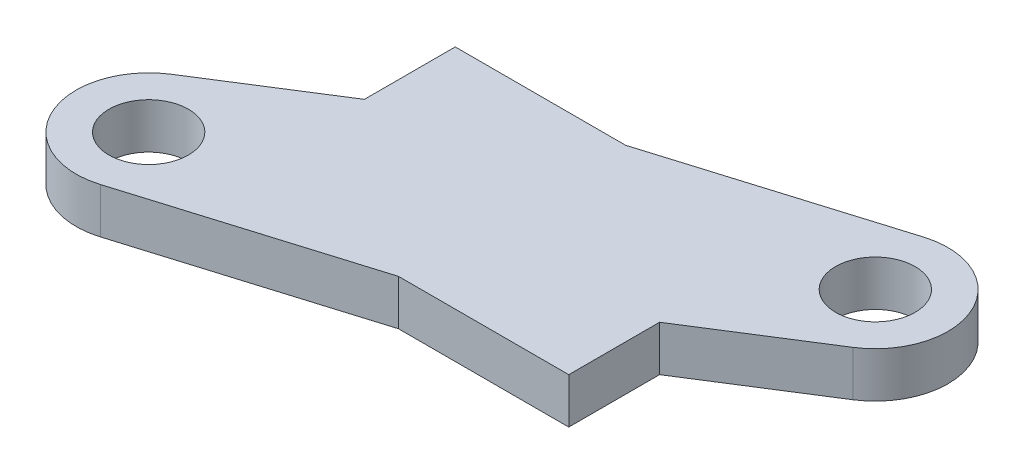
ISO-10303-21;
HEADER;
FILE_DESCRIPTION(('STEP AP214'),'2;1');
FILE_NAME('part.step','',(''),(''),'','','');
FILE_SCHEMA(('AUTOMOTIVE_DESIGN { 1 0 10303 214 1 1 1 1 }'));
ENDSEC;
DATA;
#1=APPLICATION_CONTEXT('core data for automotive mechanical design processes');
#2=APPLICATION_PROTOCOL_DEFINITION('international standard','automotive_design',2000,#1);
#3=PRODUCT_CONTEXT('',#1,'mechanical');
#4=PRODUCT('Part','Part','',(#3));
#5=PRODUCT_RELATED_PRODUCT_CATEGORY('part','',(#4));
#6=PRODUCT_DEFINITION_FORMATION('','',#4);
#7=PRODUCT_DEFINITION_CONTEXT('part definition',#1,'design');
#8=PRODUCT_DEFINITION('design','',#6,#7);
#9=PRODUCT_DEFINITION_SHAPE('','',#8);
#10=(LENGTH_UNIT() NAMED_UNIT(*) SI_UNIT(.MILLI.,.METRE.));
#11=(NAMED_UNIT(*) PLANE_ANGLE_UNIT() SI_UNIT($,.RADIAN.));
#12=(NAMED_UNIT(*) SI_UNIT($,.STERADIAN.) SOLID_ANGLE_UNIT());
#13=UNCERTAINTY_MEASURE_WITH_UNIT(LENGTH_MEASURE(1.E-05),#10,'distance_accuracy_value','');
#14=(GEOMETRIC_REPRESENTATION_CONTEXT(3) GLOBAL_UNCERTAINTY_ASSIGNED_CONTEXT((#13)) GLOBAL_UNIT_ASSIGNED_CONTEXT((#10,
#11,#12)) REPRESENTATION_CONTEXT('',''));
#15=CARTESIAN_POINT('',(0.,0.,0.));
#16=DIRECTION('',(0.,0.,1.));
#17=DIRECTION('',(1.,0.,0.));
#18=AXIS2_PLACEMENT_3D('',#15,#16,#17);
#19=CARTESIAN_POINT('',(-11.,0.,5.));
#20=DIRECTION('',(0.,1.,0.));
#21=DIRECTION('',(0.,0.,1.));
#22=AXIS2_PLACEMENT_3D('',#19,#20,#21);
#23=PLANE('',#22);
#24=CARTESIAN_POINT('',(11.,0.,-5.));
#25=DIRECTION('',(0.,-1.,0.));
#26=DIRECTION('',(0.,0.,-1.));
#27=AXIS2_PLACEMENT_3D('',#24,#25,#26);
#28=CIRCLE('',#27,1.75);
#29=CARTESIAN_POINT('',(11.,0.,-6.75));
#30=VERTEX_POINT('',#29);
#31=EDGE_CURVE('E180',#30,#30,#28,.F.);
#32=ORIENTED_EDGE('',*,*,#31,.T.);
#33=EDGE_LOOP('',(#32));
#34=FACE_BOUND('',#33,.T.);
#35=DIRECTION('',(1.,0.,0.));
#36=VECTOR('',#35,1.);
#37=CARTESIAN_POINT('',(-7.5,0.,-5.));
#38=LINE('',#37,#36);
#39=CARTESIAN_POINT('',(-7.5,0.,-5.));
#40=VERTEX_POINT('',#39);
#41=CARTESIAN_POINT('',(0.,0.,-5.));
#42=VERTEX_POINT('',#41);
#43=EDGE_CURVE('E106',#40,#42,#38,.T.);
#44=ORIENTED_EDGE('',*,*,#43,.T.);
#45=DIRECTION('',(0.956750699412572,0.,-0.290909090909091));
#46=VECTOR('',#45,1.);
#47=CARTESIAN_POINT('',(10.0690909090909,0.,-8.06160223812023));
#48=LINE('',#47,#46);
#49=CARTESIAN_POINT('',(10.0690909090909,0.,-8.06160223812023));
#50=VERTEX_POINT('',#49);
#51=EDGE_CURVE('E103',#42,#50,#48,.T.);
#52=ORIENTED_EDGE('',*,*,#51,.T.);
#53=CARTESIAN_POINT('',(11.,0.,-5.));
#54=DIRECTION('',(0.,-1.,0.));
#55=DIRECTION('',(0.,0.,-1.));
#56=AXIS2_PLACEMENT_3D('',#53,#54,#55);
#57=CIRCLE('',#56,3.2);
#58=CARTESIAN_POINT('',(12.7105144267153,0.,-2.29553325108276));
#59=VERTEX_POINT('',#58);
#60=EDGE_CURVE('E92',#59,#50,#57,.F.);
#61=ORIENTED_EDGE('',*,*,#60,.F.);
#62=DIRECTION('',(-0.845145859036636,0.,0.534535758348519));
#63=VECTOR('',#62,1.);
#64=CARTESIAN_POINT('',(12.7105144267153,0.,-2.29553325108276));
#65=LINE('',#64,#63);
#66=CARTESIAN_POINT('',(7.5,0.,1.));
#67=VERTEX_POINT('',#66);
#68=EDGE_CURVE('E125',#59,#67,#65,.T.);
#69=ORIENTED_EDGE('',*,*,#68,.T.);
#70=DIRECTION('',(0.,0.,1.));
#71=VECTOR('',#70,1.);
#72=CARTESIAN_POINT('',(7.5,0.,1.));
#73=LINE('',#72,#71);
#74=CARTESIAN_POINT('',(7.5,0.,5.));
#75=VERTEX_POINT('',#74);
#76=EDGE_CURVE('E128',#67,#75,#73,.T.);
#77=ORIENTED_EDGE('',*,*,#76,.T.);
#78=DIRECTION('',(-1.,0.,0.));
#79=VECTOR('',#78,1.);
#80=CARTESIAN_POINT('',(0.,0.,5.));
#81=LINE('',#80,#79);
#82=CARTESIAN_POINT('',(0.,0.,5.));
#83=VERTEX_POINT('',#82);
#84=EDGE_CURVE('E140',#75,#83,#81,.T.);
#85=ORIENTED_EDGE('',*,*,#84,.T.);
#86=DIRECTION('',(-0.956750699412572,0.,0.290909090909091));
#87=VECTOR('',#86,1.);
#88=CARTESIAN_POINT('',(-10.0690909090909,0.,8.06160223812024));
#89=LINE('',#88,#87);
#90=CARTESIAN_POINT('',(-10.0690909090909,0.,8.06160223812024));
#91=VERTEX_POINT('',#90);
#92=EDGE_CURVE('E150',#83,#91,#89,.T.);
#93=ORIENTED_EDGE('',*,*,#92,.T.);
#94=CARTESIAN_POINT('',(-11.,0.,5.));
#95=DIRECTION('',(0.,-1.,0.));
#96=DIRECTION('',(0.,0.,-1.));
#97=AXIS2_PLACEMENT_3D('',#94,#95,#96);
#98=CIRCLE('',#97,3.2);
#99=CARTESIAN_POINT('',(-12.7105144267153,0.,2.29553325108277));
#100=VERTEX_POINT('',#99);
#101=EDGE_CURVE('E158',#100,#91,#98,.F.);
#102=ORIENTED_EDGE('',*,*,#101,.F.);
#103=DIRECTION('',(0.845145859036636,0.,-0.534535758348519));
#104=VECTOR('',#103,1.);
#105=CARTESIAN_POINT('',(-12.7105144267153,0.,2.29553325108277));
#106=LINE('',#105,#104);
#107=CARTESIAN_POINT('',(-7.5,0.,-1.));
#108=VERTEX_POINT('',#107);
#109=EDGE_CURVE('E161',#100,#108,#106,.T.);
#110=ORIENTED_EDGE('',*,*,#109,.T.);
#111=DIRECTION('',(0.,0.,-1.));
#112=VECTOR('',#111,1.);
#113=CARTESIAN_POINT('',(-7.5,0.,-5.));
#114=LINE('',#113,#112);
#115=EDGE_CURVE('E162',#108,#40,#114,.T.);
#116=ORIENTED_EDGE('',*,*,#115,.T.);
#117=EDGE_LOOP('',(#44,#52,#61,#69,#77,#85,#93,#102,#110,#116));
#118=FACE_BOUND('',#117,.T.);
#119=CARTESIAN_POINT('',(-11.,0.,5.));
#120=DIRECTION('',(0.,-1.,0.));
#121=DIRECTION('',(0.,0.,-1.));
#122=AXIS2_PLACEMENT_3D('',#119,#120,#121);
#123=CIRCLE('',#122,1.75);
#124=CARTESIAN_POINT('',(-11.,0.,3.25));
#125=VERTEX_POINT('',#124);
#126=EDGE_CURVE('E20',#125,#125,#123,.F.);
#127=ORIENTED_EDGE('',*,*,#126,.T.);
#128=EDGE_LOOP('',(#127));
#129=FACE_BOUND('',#128,.T.);
#130=ADVANCED_FACE('F17',(#34,#118,#129),#23,.F.);
#131=CARTESIAN_POINT('',(-11.,2.,5.));
#132=DIRECTION('',(0.,-1.,0.));
#133=DIRECTION('',(0.,0.,-1.));
#134=AXIS2_PLACEMENT_3D('',#131,#132,#133);
#135=CYLINDRICAL_SURFACE('',#134,1.75);
#136=CARTESIAN_POINT('',(-11.,2.,5.));
#137=DIRECTION('',(0.,-1.,0.));
#138=DIRECTION('',(0.,0.,-1.));
#139=AXIS2_PLACEMENT_3D('',#136,#137,#138);
#140=CIRCLE('',#139,1.75);
#141=CARTESIAN_POINT('',(-11.,2.,3.25));
#142=VERTEX_POINT('',#141);
#143=EDGE_CURVE('E169',#142,#142,#140,.T.);
#144=ORIENTED_EDGE('',*,*,#143,.F.);
#145=EDGE_LOOP('',(#144));
#146=FACE_BOUND('',#145,.T.);
#147=ORIENTED_EDGE('',*,*,#126,.F.);
#148=EDGE_LOOP('',(#147));
#149=FACE_BOUND('',#148,.T.);
#150=ADVANCED_FACE('F335',(#146,#149),#135,.F.);
#151=CARTESIAN_POINT('',(-7.5,2.,-5.));
#152=DIRECTION('',(1.,0.,0.));
#153=DIRECTION('',(0.,0.,-1.));
#154=AXIS2_PLACEMENT_3D('',#151,#152,#153);
#155=PLANE('',#154);
#156=DIRECTION('',(0.,1.,0.));
#157=VECTOR('',#156,1.);
#158=CARTESIAN_POINT('',(-7.5,2.,-1.));
#159=LINE('',#158,#157);
#160=CARTESIAN_POINT('',(-7.5,2.,-1.));
#161=VERTEX_POINT('',#160);
#162=EDGE_CURVE('E159',#108,#161,#159,.T.);
#163=ORIENTED_EDGE('',*,*,#162,.T.);
#164=DIRECTION('',(0.,0.,1.));
#165=VECTOR('',#164,1.);
#166=CARTESIAN_POINT('',(-7.5,2.,5.));
#167=LINE('',#166,#165);
#168=CARTESIAN_POINT('',(-7.5,2.,-5.));
#169=VERTEX_POINT('',#168);
#170=EDGE_CURVE('E165',#169,#161,#167,.T.);
#171=ORIENTED_EDGE('',*,*,#170,.F.);
#172=DIRECTION('',(0.,1.,0.));
#173=VECTOR('',#172,1.);
#174=CARTESIAN_POINT('',(-7.5,2.,-5.));
#175=LINE('',#174,#173);
#176=EDGE_CURVE('E121',#169,#40,#175,.F.);
#177=ORIENTED_EDGE('',*,*,#176,.T.);
#178=ORIENTED_EDGE('',*,*,#115,.F.);
#179=EDGE_LOOP('',(#163,#171,#177,#178));
#180=FACE_BOUND('',#179,.T.);
#181=ADVANCED_FACE('F328',(#180),#155,.F.);
#182=CARTESIAN_POINT('',(-12.7105144267153,2.,2.29553325108277));
#183=DIRECTION('',(0.534535758348519,0.,0.845145859036636));
#184=DIRECTION('',(0.845145859036636,0.,-0.534535758348519));
#185=AXIS2_PLACEMENT_3D('',#182,#183,#184);
#186=PLANE('',#185);
#187=DIRECTION('',(0.,-1.,0.));
#188=VECTOR('',#187,1.);
#189=CARTESIAN_POINT('',(-12.7105144267153,2.,2.29553325108276));
#190=LINE('',#189,#188);
#191=CARTESIAN_POINT('',(-12.7105144267153,2.,2.29553325108276));
#192=VERTEX_POINT('',#191);
#193=EDGE_CURVE('E155',#192,#100,#190,.T.);
#194=ORIENTED_EDGE('',*,*,#193,.F.);
#195=DIRECTION('',(-0.845145859036636,0.,0.534535758348519));
#196=VECTOR('',#195,1.);
#197=CARTESIAN_POINT('',(-7.5,2.,-1.));
#198=LINE('',#197,#196);
#199=EDGE_CURVE('E168',#161,#192,#198,.T.);
#200=ORIENTED_EDGE('',*,*,#199,.F.);
#201=ORIENTED_EDGE('',*,*,#162,.F.);
#202=ORIENTED_EDGE('',*,*,#109,.F.);
#203=EDGE_LOOP('',(#194,#200,#201,#202));
#204=FACE_BOUND('',#203,.T.);
#205=ADVANCED_FACE('F321',(#204),#186,.F.);
#206=CARTESIAN_POINT('',(-11.,2.,5.));
#207=DIRECTION('',(0.,-1.,0.));
#208=DIRECTION('',(0.,0.,-1.));
#209=AXIS2_PLACEMENT_3D('',#206,#207,#208);
#210=CYLINDRICAL_SURFACE('',#209,3.2);
#211=CARTESIAN_POINT('',(-11.,2.,5.));
#212=DIRECTION('',(0.,-1.,0.));
#213=DIRECTION('',(0.,0.,-1.));
#214=AXIS2_PLACEMENT_3D('',#211,#212,#213);
#215=CIRCLE('',#214,3.2);
#216=CARTESIAN_POINT('',(-10.0690909090909,2.,8.06160223812024));
#217=VERTEX_POINT('',#216);
#218=EDGE_CURVE('E206',#192,#217,#215,.F.);
#219=ORIENTED_EDGE('',*,*,#218,.F.);
#220=ORIENTED_EDGE('',*,*,#193,.T.);
#221=ORIENTED_EDGE('',*,*,#101,.T.);
#222=DIRECTION('',(0.,1.,0.));
#223=VECTOR('',#222,1.);
#224=CARTESIAN_POINT('',(-10.0690909090909,2.,8.06160223812024));
#225=LINE('',#224,#223);
#226=EDGE_CURVE('E153',#91,#217,#225,.T.);
#227=ORIENTED_EDGE('',*,*,#226,.T.);
#228=EDGE_LOOP('',(#219,#220,#221,#227));
#229=FACE_BOUND('',#228,.T.);
#230=ADVANCED_FACE('F214',(#229),#210,.T.);
#231=CARTESIAN_POINT('',(-10.0690909090909,2.,8.06160223812024));
#232=DIRECTION('',(-0.290909090909091,0.,-0.956750699412572));
#233=DIRECTION('',(-0.956750699412572,0.,0.290909090909091));
#234=AXIS2_PLACEMENT_3D('',#231,#232,#233);
#235=PLANE('',#234);
#236=DIRECTION('',(0.,1.,0.));
#237=VECTOR('',#236,1.);
#238=CARTESIAN_POINT('',(0.,2.,5.));
#239=LINE('',#238,#237);
#240=CARTESIAN_POINT('',(0.,2.,5.));
#241=VERTEX_POINT('',#240);
#242=EDGE_CURVE('E148',#83,#241,#239,.T.);
#243=ORIENTED_EDGE('',*,*,#242,.T.);
#244=DIRECTION('',(0.956750699412572,0.,-0.290909090909091));
#245=VECTOR('',#244,1.);
#246=CARTESIAN_POINT('',(-10.0690909090909,2.,8.06160223812024));
#247=LINE('',#246,#245);
#248=EDGE_CURVE('E145',#217,#241,#247,.T.);
#249=ORIENTED_EDGE('',*,*,#248,.F.);
#250=ORIENTED_EDGE('',*,*,#226,.F.);
#251=ORIENTED_EDGE('',*,*,#92,.F.);
#252=EDGE_LOOP('',(#243,#249,#250,#251));
#253=FACE_BOUND('',#252,.T.);
#254=ADVANCED_FACE('F220',(#253),#235,.F.);
#255=CARTESIAN_POINT('',(0.,2.,5.));
#256=DIRECTION('',(0.,0.,-1.));
#257=DIRECTION('',(-1.,0.,0.));
#258=AXIS2_PLACEMENT_3D('',#255,#256,#257);
#259=PLANE('',#258);
#260=DIRECTION('',(0.,1.,0.));
#261=VECTOR('',#260,1.);
#262=CARTESIAN_POINT('',(7.5,2.,5.));
#263=LINE('',#262,#261);
#264=CARTESIAN_POINT('',(7.5,2.,5.));
#265=VERTEX_POINT('',#264);
#266=EDGE_CURVE('E138',#75,#265,#263,.T.);
#267=ORIENTED_EDGE('',*,*,#266,.T.);
#268=DIRECTION('',(1.,0.,0.));
#269=VECTOR('',#268,1.);
#270=CARTESIAN_POINT('',(-11.,2.,5.));
#271=LINE('',#270,#269);
#272=EDGE_CURVE('E135',#241,#265,#271,.T.);
#273=ORIENTED_EDGE('',*,*,#272,.F.);
#274=ORIENTED_EDGE('',*,*,#242,.F.);
#275=ORIENTED_EDGE('',*,*,#84,.F.);
#276=EDGE_LOOP('',(#267,#273,#274,#275));
#277=FACE_BOUND('',#276,.T.);
#278=ADVANCED_FACE('F250',(#277),#259,.F.);
#279=CARTESIAN_POINT('',(7.5,2.,1.));
#280=DIRECTION('',(-1.,0.,0.));
#281=DIRECTION('',(0.,0.,1.));
#282=AXIS2_PLACEMENT_3D('',#279,#280,#281);
#283=PLANE('',#282);
#284=DIRECTION('',(0.,1.,0.));
#285=VECTOR('',#284,1.);
#286=CARTESIAN_POINT('',(7.5,2.,1.));
#287=LINE('',#286,#285);
#288=CARTESIAN_POINT('',(7.5,2.,1.));
#289=VERTEX_POINT('',#288);
#290=EDGE_CURVE('E126',#67,#289,#287,.T.);
#291=ORIENTED_EDGE('',*,*,#290,.T.);
#292=DIRECTION('',(0.,0.,1.));
#293=VECTOR('',#292,1.);
#294=CARTESIAN_POINT('',(7.5,2.,5.));
#295=LINE('',#294,#293);
#296=EDGE_CURVE('E131',#265,#289,#295,.F.);
#297=ORIENTED_EDGE('',*,*,#296,.F.);
#298=ORIENTED_EDGE('',*,*,#266,.F.);
#299=ORIENTED_EDGE('',*,*,#76,.F.);
#300=EDGE_LOOP('',(#291,#297,#298,#299));
#301=FACE_BOUND('',#300,.T.);
#302=ADVANCED_FACE('F248',(#301),#283,.F.);
#303=CARTESIAN_POINT('',(12.7105144267153,2.,-2.29553325108276));
#304=DIRECTION('',(-0.534535758348519,0.,-0.845145859036636));
#305=DIRECTION('',(-0.845145859036636,0.,0.534535758348519));
#306=AXIS2_PLACEMENT_3D('',#303,#304,#305);
#307=PLANE('',#306);
#308=DIRECTION('',(0.,-1.,0.));
#309=VECTOR('',#308,1.);
#310=CARTESIAN_POINT('',(12.7105144267153,2.,-2.29553325108276));
#311=LINE('',#310,#309);
#312=CARTESIAN_POINT('',(12.7105144267153,2.,-2.29553325108276));
#313=VERTEX_POINT('',#312);
#314=EDGE_CURVE('E98',#313,#59,#311,.T.);
#315=ORIENTED_EDGE('',*,*,#314,.F.);
#316=DIRECTION('',(0.845145859036636,0.,-0.534535758348519));
#317=VECTOR('',#316,1.);
#318=CARTESIAN_POINT('',(7.5,2.,1.));
#319=LINE('',#318,#317);
#320=EDGE_CURVE('E134',#289,#313,#319,.T.);
#321=ORIENTED_EDGE('',*,*,#320,.F.);
#322=ORIENTED_EDGE('',*,*,#290,.F.);
#323=ORIENTED_EDGE('',*,*,#68,.F.);
#324=EDGE_LOOP('',(#315,#321,#322,#323));
#325=FACE_BOUND('',#324,.T.);
#326=ADVANCED_FACE('F245',(#325),#307,.F.);
#327=CARTESIAN_POINT('',(11.,2.,-5.));
#328=DIRECTION('',(0.,-1.,0.));
#329=DIRECTION('',(0.,0.,-1.));
#330=AXIS2_PLACEMENT_3D('',#327,#328,#329);
#331=CYLINDRICAL_SURFACE('',#330,3.2);
#332=ORIENTED_EDGE('',*,*,#314,.T.);
#333=ORIENTED_EDGE('',*,*,#60,.T.);
#334=DIRECTION('',(0.,1.,0.));
#335=VECTOR('',#334,1.);
#336=CARTESIAN_POINT('',(10.0690909090909,2.,-8.06160223812023));
#337=LINE('',#336,#335);
#338=CARTESIAN_POINT('',(10.0690909090909,2.,-8.06160223812023));
#339=VERTEX_POINT('',#338);
#340=EDGE_CURVE('E97',#50,#339,#337,.T.);
#341=ORIENTED_EDGE('',*,*,#340,.T.);
#342=CARTESIAN_POINT('',(11.,2.,-5.));
#343=DIRECTION('',(0.,-1.,0.));
#344=DIRECTION('',(0.,0.,-1.));
#345=AXIS2_PLACEMENT_3D('',#342,#343,#344);
#346=CIRCLE('',#345,3.2);
#347=EDGE_CURVE('E204',#313,#339,#346,.F.);
#348=ORIENTED_EDGE('',*,*,#347,.F.);
#349=EDGE_LOOP('',(#332,#333,#341,#348));
#350=FACE_BOUND('',#349,.T.);
#351=ADVANCED_FACE('F94',(#350),#331,.T.);
#352=CARTESIAN_POINT('',(10.0690909090909,2.,-8.06160223812023));
#353=DIRECTION('',(0.290909090909091,0.,0.956750699412572));
#354=DIRECTION('',(0.956750699412572,0.,-0.290909090909091));
#355=AXIS2_PLACEMENT_3D('',#352,#353,#354);
#356=PLANE('',#355);
#357=DIRECTION('',(0.,1.,0.));
#358=VECTOR('',#357,1.);
#359=CARTESIAN_POINT('',(0.,2.,-5.));
#360=LINE('',#359,#358);
#361=CARTESIAN_POINT('',(0.,2.,-5.));
#362=VERTEX_POINT('',#361);
#363=EDGE_CURVE('E34',#42,#362,#360,.T.);
#364=ORIENTED_EDGE('',*,*,#363,.T.);
#365=DIRECTION('',(-0.956750699412572,0.,0.290909090909091));
#366=VECTOR('',#365,1.);
#367=CARTESIAN_POINT('',(10.0690909090909,2.,-8.06160223812023));
#368=LINE('',#367,#366);
#369=EDGE_CURVE('E110',#339,#362,#368,.T.);
#370=ORIENTED_EDGE('',*,*,#369,.F.);
#371=ORIENTED_EDGE('',*,*,#340,.F.);
#372=ORIENTED_EDGE('',*,*,#51,.F.);
#373=EDGE_LOOP('',(#364,#370,#371,#372));
#374=FACE_BOUND('',#373,.T.);
#375=ADVANCED_FACE('F108',(#374),#356,.F.);
#376=CARTESIAN_POINT('',(-7.5,2.,-5.));
#377=DIRECTION('',(0.,0.,1.));
#378=DIRECTION('',(1.,0.,0.));
#379=AXIS2_PLACEMENT_3D('',#376,#377,#378);
#380=PLANE('',#379);
#381=ORIENTED_EDGE('',*,*,#176,.F.);
#382=DIRECTION('',(1.,0.,0.));
#383=VECTOR('',#382,1.);
#384=CARTESIAN_POINT('',(-11.,2.,-5.));
#385=LINE('',#384,#383);
#386=EDGE_CURVE('E26',#362,#169,#385,.F.);
#387=ORIENTED_EDGE('',*,*,#386,.F.);
#388=ORIENTED_EDGE('',*,*,#363,.F.);
#389=ORIENTED_EDGE('',*,*,#43,.F.);
#390=EDGE_LOOP('',(#381,#387,#388,#389));
#391=FACE_BOUND('',#390,.T.);
#392=ADVANCED_FACE('F267',(#391),#380,.F.);
#393=CARTESIAN_POINT('',(11.,2.,-5.));
#394=DIRECTION('',(0.,-1.,0.));
#395=DIRECTION('',(0.,0.,-1.));
#396=AXIS2_PLACEMENT_3D('',#393,#394,#395);
#397=CYLINDRICAL_SURFACE('',#396,1.75);
#398=CARTESIAN_POINT('',(11.,2.,-5.));
#399=DIRECTION('',(0.,-1.,0.));
#400=DIRECTION('',(0.,0.,-1.));
#401=AXIS2_PLACEMENT_3D('',#398,#399,#400);
#402=CIRCLE('',#401,1.75);
#403=CARTESIAN_POINT('',(11.,2.,-6.75));
#404=VERTEX_POINT('',#403);
#405=EDGE_CURVE('E11',#404,#404,#402,.T.);
#406=ORIENTED_EDGE('',*,*,#405,.F.);
#407=EDGE_LOOP('',(#406));
#408=FACE_BOUND('',#407,.T.);
#409=ORIENTED_EDGE('',*,*,#31,.F.);
#410=EDGE_LOOP('',(#409));
#411=FACE_BOUND('',#410,.T.);
#412=ADVANCED_FACE('F261',(#408,#411),#397,.F.);
#413=CARTESIAN_POINT('',(-11.,2.,5.));
#414=DIRECTION('',(0.,1.,0.));
#415=DIRECTION('',(0.,0.,1.));
#416=AXIS2_PLACEMENT_3D('',#413,#414,#415);
#417=PLANE('',#416);
#418=ORIENTED_EDGE('',*,*,#405,.T.);
#419=EDGE_LOOP('',(#418));
#420=FACE_BOUND('',#419,.T.);
#421=ORIENTED_EDGE('',*,*,#369,.T.);
#422=ORIENTED_EDGE('',*,*,#386,.T.);
#423=ORIENTED_EDGE('',*,*,#170,.T.);
#424=ORIENTED_EDGE('',*,*,#199,.T.);
#425=ORIENTED_EDGE('',*,*,#218,.T.);
#426=ORIENTED_EDGE('',*,*,#248,.T.);
#427=ORIENTED_EDGE('',*,*,#272,.T.);
#428=ORIENTED_EDGE('',*,*,#296,.T.);
#429=ORIENTED_EDGE('',*,*,#320,.T.);
#430=ORIENTED_EDGE('',*,*,#347,.T.);
#431=EDGE_LOOP('',(#421,#422,#423,#424,#425,#426,#427,#428,#429,#430));
#432=FACE_BOUND('',#431,.T.);
#433=ORIENTED_EDGE('',*,*,#143,.T.);
#434=EDGE_LOOP('',(#433));
#435=FACE_BOUND('',#434,.T.);
#436=ADVANCED_FACE('F226',(#420,#432,#435),#417,.T.);
#437=CLOSED_SHELL('',(#130,#150,#181,#205,#230,#254,#278,#302,#326,#351,#375,#392,#412,#436));
#438=MANIFOLD_SOLID_BREP('B1',#437);
#439=ADVANCED_BREP_SHAPE_REPRESENTATION('',(#18,#438),#14);
#440=SHAPE_DEFINITION_REPRESENTATION(#9,#439);
ENDSEC;
END-ISO-10303-21;
